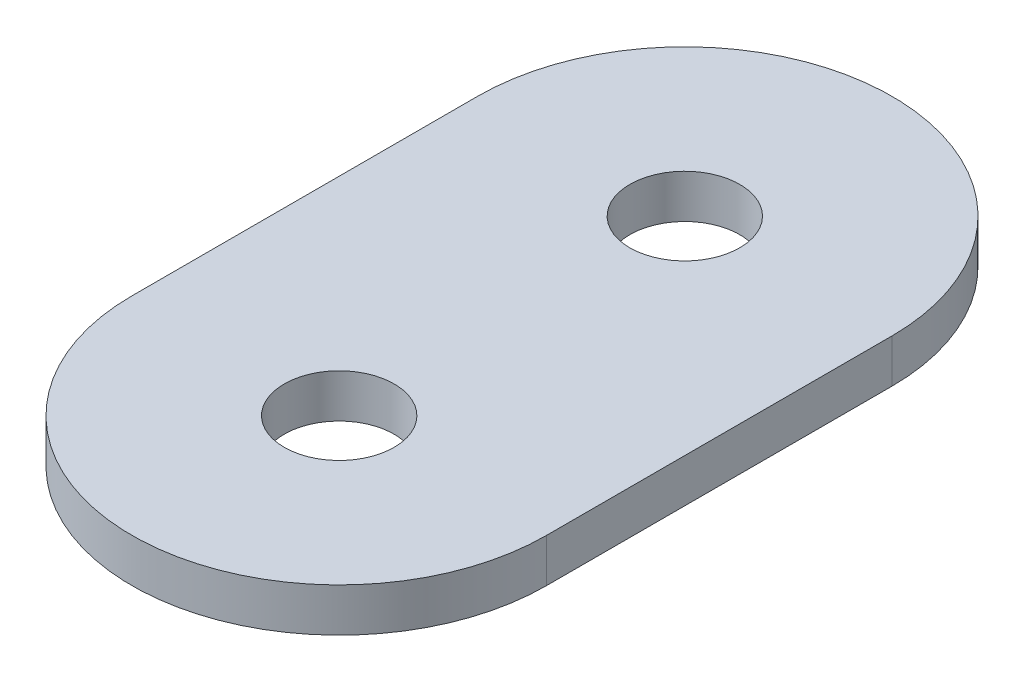
ISO-10303-21;
HEADER;
FILE_DESCRIPTION(('STEP AP214'),'2;1');
FILE_NAME('part.step','',(''),(''),'','','');
FILE_SCHEMA(('AUTOMOTIVE_DESIGN { 1 0 10303 214 1 1 1 1 }'));
ENDSEC;
DATA;
#1=APPLICATION_CONTEXT('core data for automotive mechanical design processes');
#2=APPLICATION_PROTOCOL_DEFINITION('international standard','automotive_design',2000,#1);
#3=PRODUCT_CONTEXT('',#1,'mechanical');
#4=PRODUCT('Part','Part','',(#3));
#5=PRODUCT_RELATED_PRODUCT_CATEGORY('part','',(#4));
#6=PRODUCT_DEFINITION_FORMATION('','',#4);
#7=PRODUCT_DEFINITION_CONTEXT('part definition',#1,'design');
#8=PRODUCT_DEFINITION('design','',#6,#7);
#9=PRODUCT_DEFINITION_SHAPE('','',#8);
#10=(LENGTH_UNIT() NAMED_UNIT(*) SI_UNIT(.MILLI.,.METRE.));
#11=(NAMED_UNIT(*) PLANE_ANGLE_UNIT() SI_UNIT($,.RADIAN.));
#12=(NAMED_UNIT(*) SI_UNIT($,.STERADIAN.) SOLID_ANGLE_UNIT());
#13=UNCERTAINTY_MEASURE_WITH_UNIT(LENGTH_MEASURE(1.E-05),#10,'distance_accuracy_value','');
#14=(GEOMETRIC_REPRESENTATION_CONTEXT(3) GLOBAL_UNCERTAINTY_ASSIGNED_CONTEXT((#13)) GLOBAL_UNIT_ASSIGNED_CONTEXT((#10,
#11,#12)) REPRESENTATION_CONTEXT('',''));
#15=CARTESIAN_POINT('',(0.,0.,0.));
#16=DIRECTION('',(0.,0.,1.));
#17=DIRECTION('',(1.,0.,0.));
#18=AXIS2_PLACEMENT_3D('',#15,#16,#17);
#19=CARTESIAN_POINT('',(0.,0.8001,-6.35));
#20=DIRECTION('',(0.,-1.,0.));
#21=DIRECTION('',(0.,0.,-1.));
#22=AXIS2_PLACEMENT_3D('',#19,#20,#21);
#23=PLANE('',#22);
#24=CARTESIAN_POINT('',(0.,0.8001,-6.35));
#25=DIRECTION('',(0.,1.,0.));
#26=DIRECTION('',(0.,0.,-1.));
#27=AXIS2_PLACEMENT_3D('',#24,#25,#26);
#28=CIRCLE('',#27,7.62);
#29=CARTESIAN_POINT('',(7.62,0.8001,-6.35));
#30=VERTEX_POINT('',#29);
#31=CARTESIAN_POINT('',(-7.62,0.8001,-6.35));
#32=VERTEX_POINT('',#31);
#33=EDGE_CURVE('E87',#30,#32,#28,.T.);
#34=ORIENTED_EDGE('',*,*,#33,.T.);
#35=DIRECTION('',(0.,0.,1.));
#36=VECTOR('',#35,1.);
#37=CARTESIAN_POINT('',(-7.62,0.8001,6.35));
#38=LINE('',#37,#36);
#39=CARTESIAN_POINT('',(-7.62,0.8001,6.35));
#40=VERTEX_POINT('',#39);
#41=EDGE_CURVE('E82',#32,#40,#38,.T.);
#42=ORIENTED_EDGE('',*,*,#41,.T.);
#43=CARTESIAN_POINT('',(0.,0.8001,6.35));
#44=DIRECTION('',(0.,1.,0.));
#45=DIRECTION('',(0.,0.,-1.));
#46=AXIS2_PLACEMENT_3D('',#43,#44,#45);
#47=CIRCLE('',#46,7.62);
#48=CARTESIAN_POINT('',(7.62,0.8001,6.35));
#49=VERTEX_POINT('',#48);
#50=EDGE_CURVE('E85',#40,#49,#47,.T.);
#51=ORIENTED_EDGE('',*,*,#50,.T.);
#52=DIRECTION('',(0.,0.,-1.));
#53=VECTOR('',#52,1.);
#54=CARTESIAN_POINT('',(7.62,0.8001,-6.35));
#55=LINE('',#54,#53);
#56=EDGE_CURVE('E52',#49,#30,#55,.T.);
#57=ORIENTED_EDGE('',*,*,#56,.T.);
#58=EDGE_LOOP('',(#34,#42,#51,#57));
#59=FACE_BOUND('',#58,.T.);
#60=CARTESIAN_POINT('',(0.,0.8001,-6.35));
#61=DIRECTION('',(0.,1.,0.));
#62=DIRECTION('',(0.,0.,1.));
#63=AXIS2_PLACEMENT_3D('',#60,#61,#62);
#64=CIRCLE('',#63,2.0193);
#65=CARTESIAN_POINT('',(0.,0.8001,-4.3307));
#66=VERTEX_POINT('',#65);
#67=EDGE_CURVE('E102',#66,#66,#64,.T.);
#68=ORIENTED_EDGE('',*,*,#67,.F.);
#69=EDGE_LOOP('',(#68));
#70=FACE_BOUND('',#69,.T.);
#71=CARTESIAN_POINT('',(0.,0.8001,6.35));
#72=DIRECTION('',(0.,1.,0.));
#73=DIRECTION('',(0.,0.,1.));
#74=AXIS2_PLACEMENT_3D('',#71,#72,#73);
#75=CIRCLE('',#74,2.0193);
#76=CARTESIAN_POINT('',(0.,0.8001,8.3693));
#77=VERTEX_POINT('',#76);
#78=EDGE_CURVE('E117',#77,#77,#75,.T.);
#79=ORIENTED_EDGE('',*,*,#78,.F.);
#80=EDGE_LOOP('',(#79));
#81=FACE_BOUND('',#80,.T.);
#82=ADVANCED_FACE('F35',(#59,#70,#81),#23,.F.);
#83=CARTESIAN_POINT('',(0.,-0.8001,-6.35));
#84=DIRECTION('',(0.,-1.,0.));
#85=DIRECTION('',(0.,0.,-1.));
#86=AXIS2_PLACEMENT_3D('',#83,#84,#85);
#87=PLANE('',#86);
#88=CARTESIAN_POINT('',(0.,-0.8001,-6.35));
#89=DIRECTION('',(0.,1.,0.));
#90=DIRECTION('',(0.,0.,1.));
#91=AXIS2_PLACEMENT_3D('',#88,#89,#90);
#92=CIRCLE('',#91,2.0193);
#93=CARTESIAN_POINT('',(0.,-0.8001,-4.3307));
#94=VERTEX_POINT('',#93);
#95=EDGE_CURVE('E114',#94,#94,#92,.T.);
#96=ORIENTED_EDGE('',*,*,#95,.T.);
#97=EDGE_LOOP('',(#96));
#98=FACE_BOUND('',#97,.T.);
#99=CARTESIAN_POINT('',(0.,-0.8001,-6.35));
#100=DIRECTION('',(0.,1.,0.));
#101=DIRECTION('',(0.,0.,-1.));
#102=AXIS2_PLACEMENT_3D('',#99,#100,#101);
#103=CIRCLE('',#102,7.62);
#104=CARTESIAN_POINT('',(7.62,-0.8001,-6.35));
#105=VERTEX_POINT('',#104);
#106=CARTESIAN_POINT('',(-7.62,-0.8001,-6.35));
#107=VERTEX_POINT('',#106);
#108=EDGE_CURVE('E99',#105,#107,#103,.T.);
#109=ORIENTED_EDGE('',*,*,#108,.F.);
#110=DIRECTION('',(0.,0.,-1.));
#111=VECTOR('',#110,1.);
#112=CARTESIAN_POINT('',(7.62,-0.8001,-6.35));
#113=LINE('',#112,#111);
#114=CARTESIAN_POINT('',(7.62,-0.8001,6.35));
#115=VERTEX_POINT('',#114);
#116=EDGE_CURVE('E75',#115,#105,#113,.T.);
#117=ORIENTED_EDGE('',*,*,#116,.F.);
#118=CARTESIAN_POINT('',(0.,-0.8001,6.35));
#119=DIRECTION('',(0.,1.,0.));
#120=DIRECTION('',(0.,0.,-1.));
#121=AXIS2_PLACEMENT_3D('',#118,#119,#120);
#122=CIRCLE('',#121,7.62);
#123=CARTESIAN_POINT('',(-7.62,-0.8001,6.35));
#124=VERTEX_POINT('',#123);
#125=EDGE_CURVE('E69',#124,#115,#122,.T.);
#126=ORIENTED_EDGE('',*,*,#125,.F.);
#127=DIRECTION('',(0.,0.,1.));
#128=VECTOR('',#127,1.);
#129=CARTESIAN_POINT('',(-7.62,-0.8001,6.35));
#130=LINE('',#129,#128);
#131=EDGE_CURVE('E91',#107,#124,#130,.T.);
#132=ORIENTED_EDGE('',*,*,#131,.F.);
#133=EDGE_LOOP('',(#109,#117,#126,#132));
#134=FACE_BOUND('',#133,.T.);
#135=CARTESIAN_POINT('',(0.,-0.8001,6.35));
#136=DIRECTION('',(0.,1.,0.));
#137=DIRECTION('',(0.,0.,1.));
#138=AXIS2_PLACEMENT_3D('',#135,#136,#137);
#139=CIRCLE('',#138,2.0193);
#140=CARTESIAN_POINT('',(0.,-0.8001,8.3693));
#141=VERTEX_POINT('',#140);
#142=EDGE_CURVE('E120',#141,#141,#139,.T.);
#143=ORIENTED_EDGE('',*,*,#142,.T.);
#144=EDGE_LOOP('',(#143));
#145=FACE_BOUND('',#144,.T.);
#146=ADVANCED_FACE('F110',(#98,#134,#145),#87,.T.);
#147=CARTESIAN_POINT('',(0.,0.8001,-6.35));
#148=DIRECTION('',(0.,-1.,0.));
#149=DIRECTION('',(0.,0.,-1.));
#150=AXIS2_PLACEMENT_3D('',#147,#148,#149);
#151=CYLINDRICAL_SURFACE('',#150,7.62);
#152=ORIENTED_EDGE('',*,*,#108,.T.);
#153=DIRECTION('',(0.,-1.,0.));
#154=VECTOR('',#153,1.);
#155=CARTESIAN_POINT('',(-7.62,0.8001,-6.35));
#156=LINE('',#155,#154);
#157=EDGE_CURVE('E11',#32,#107,#156,.T.);
#158=ORIENTED_EDGE('',*,*,#157,.F.);
#159=ORIENTED_EDGE('',*,*,#33,.F.);
#160=DIRECTION('',(0.,-1.,0.));
#161=VECTOR('',#160,1.);
#162=CARTESIAN_POINT('',(7.62,0.8001,-6.35));
#163=LINE('',#162,#161);
#164=EDGE_CURVE('E95',#30,#105,#163,.T.);
#165=ORIENTED_EDGE('',*,*,#164,.T.);
#166=EDGE_LOOP('',(#152,#158,#159,#165));
#167=FACE_BOUND('',#166,.T.);
#168=ADVANCED_FACE('F37',(#167),#151,.T.);
#169=CARTESIAN_POINT('',(-7.62,0.8001,6.35));
#170=DIRECTION('',(1.,0.,0.));
#171=DIRECTION('',(0.,0.,-1.));
#172=AXIS2_PLACEMENT_3D('',#169,#170,#171);
#173=PLANE('',#172);
#174=ORIENTED_EDGE('',*,*,#131,.T.);
#175=DIRECTION('',(0.,-1.,0.));
#176=VECTOR('',#175,1.);
#177=CARTESIAN_POINT('',(-7.62,0.8001,6.35));
#178=LINE('',#177,#176);
#179=EDGE_CURVE('E44',#40,#124,#178,.T.);
#180=ORIENTED_EDGE('',*,*,#179,.F.);
#181=ORIENTED_EDGE('',*,*,#41,.F.);
#182=ORIENTED_EDGE('',*,*,#157,.T.);
#183=EDGE_LOOP('',(#174,#180,#181,#182));
#184=FACE_BOUND('',#183,.T.);
#185=ADVANCED_FACE('F90',(#184),#173,.F.);
#186=CARTESIAN_POINT('',(0.,0.8001,6.35));
#187=DIRECTION('',(0.,-1.,0.));
#188=DIRECTION('',(0.,0.,-1.));
#189=AXIS2_PLACEMENT_3D('',#186,#187,#188);
#190=CYLINDRICAL_SURFACE('',#189,7.62);
#191=ORIENTED_EDGE('',*,*,#125,.T.);
#192=DIRECTION('',(0.,-1.,0.));
#193=VECTOR('',#192,1.);
#194=CARTESIAN_POINT('',(7.62,0.8001,6.35));
#195=LINE('',#194,#193);
#196=EDGE_CURVE('E92',#49,#115,#195,.T.);
#197=ORIENTED_EDGE('',*,*,#196,.F.);
#198=ORIENTED_EDGE('',*,*,#50,.F.);
#199=ORIENTED_EDGE('',*,*,#179,.T.);
#200=EDGE_LOOP('',(#191,#197,#198,#199));
#201=FACE_BOUND('',#200,.T.);
#202=ADVANCED_FACE('F93',(#201),#190,.T.);
#203=CARTESIAN_POINT('',(7.62,0.8001,-6.35));
#204=DIRECTION('',(-1.,0.,0.));
#205=DIRECTION('',(0.,0.,1.));
#206=AXIS2_PLACEMENT_3D('',#203,#204,#205);
#207=PLANE('',#206);
#208=ORIENTED_EDGE('',*,*,#116,.T.);
#209=ORIENTED_EDGE('',*,*,#164,.F.);
#210=ORIENTED_EDGE('',*,*,#56,.F.);
#211=ORIENTED_EDGE('',*,*,#196,.T.);
#212=EDGE_LOOP('',(#208,#209,#210,#211));
#213=FACE_BOUND('',#212,.T.);
#214=ADVANCED_FACE('F107',(#213),#207,.F.);
#215=CARTESIAN_POINT('',(0.,0.8001,-6.35));
#216=DIRECTION('',(0.,-1.,0.));
#217=DIRECTION('',(0.,0.,-1.));
#218=AXIS2_PLACEMENT_3D('',#215,#216,#217);
#219=CYLINDRICAL_SURFACE('',#218,2.0193);
#220=ORIENTED_EDGE('',*,*,#67,.T.);
#221=EDGE_LOOP('',(#220));
#222=FACE_BOUND('',#221,.T.);
#223=ORIENTED_EDGE('',*,*,#95,.F.);
#224=EDGE_LOOP('',(#223));
#225=FACE_BOUND('',#224,.T.);
#226=ADVANCED_FACE('F137',(#222,#225),#219,.F.);
#227=CARTESIAN_POINT('',(0.,0.8001,6.35));
#228=DIRECTION('',(0.,-1.,0.));
#229=DIRECTION('',(0.,0.,-1.));
#230=AXIS2_PLACEMENT_3D('',#227,#228,#229);
#231=CYLINDRICAL_SURFACE('',#230,2.0193);
#232=ORIENTED_EDGE('',*,*,#78,.T.);
#233=EDGE_LOOP('',(#232));
#234=FACE_BOUND('',#233,.T.);
#235=ORIENTED_EDGE('',*,*,#142,.F.);
#236=EDGE_LOOP('',(#235));
#237=FACE_BOUND('',#236,.T.);
#238=ADVANCED_FACE('F126',(#234,#237),#231,.F.);
#239=CLOSED_SHELL('',(#82,#146,#168,#185,#202,#214,#226,#238));
#240=MANIFOLD_SOLID_BREP('B2',#239);
#241=ADVANCED_BREP_SHAPE_REPRESENTATION('',(#18,#240),#14);
#242=SHAPE_DEFINITION_REPRESENTATION(#9,#241);
ENDSEC;
END-ISO-10303-21;
